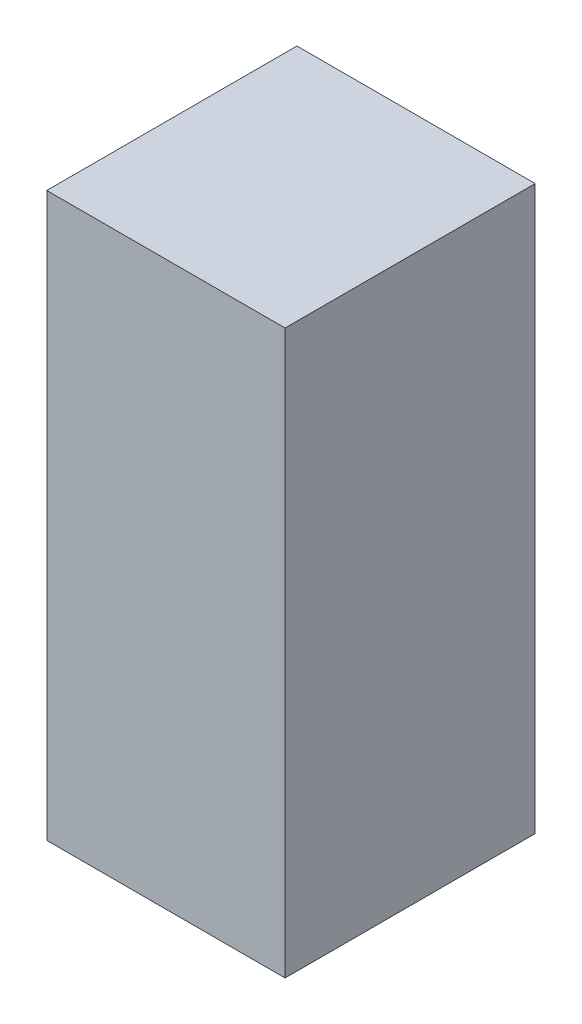
ISO-10303-21;
HEADER;
FILE_DESCRIPTION(('STEP AP214'),'2;1');
FILE_NAME('part.step','',(''),(''),'','','');
FILE_SCHEMA(('AUTOMOTIVE_DESIGN { 1 0 10303 214 1 1 1 1 }'));
ENDSEC;
DATA;
#1=APPLICATION_CONTEXT('core data for automotive mechanical design processes');
#2=APPLICATION_PROTOCOL_DEFINITION('international standard','automotive_design',2000,#1);
#3=PRODUCT_CONTEXT('',#1,'mechanical');
#4=PRODUCT('Part','Part','',(#3));
#5=PRODUCT_RELATED_PRODUCT_CATEGORY('part','',(#4));
#6=PRODUCT_DEFINITION_FORMATION('','',#4);
#7=PRODUCT_DEFINITION_CONTEXT('part definition',#1,'design');
#8=PRODUCT_DEFINITION('design','',#6,#7);
#9=PRODUCT_DEFINITION_SHAPE('','',#8);
#10=(LENGTH_UNIT() NAMED_UNIT(*) SI_UNIT(.MILLI.,.METRE.));
#11=(NAMED_UNIT(*) PLANE_ANGLE_UNIT() SI_UNIT($,.RADIAN.));
#12=(NAMED_UNIT(*) SI_UNIT($,.STERADIAN.) SOLID_ANGLE_UNIT());
#13=UNCERTAINTY_MEASURE_WITH_UNIT(LENGTH_MEASURE(1.E-05),#10,'distance_accuracy_value','');
#14=(GEOMETRIC_REPRESENTATION_CONTEXT(3) GLOBAL_UNCERTAINTY_ASSIGNED_CONTEXT((#13)) GLOBAL_UNIT_ASSIGNED_CONTEXT((#10,
#11,#12)) REPRESENTATION_CONTEXT('',''));
#15=CARTESIAN_POINT('',(0.,0.,0.));
#16=DIRECTION('',(0.,0.,1.));
#17=DIRECTION('',(1.,0.,0.));
#18=AXIS2_PLACEMENT_3D('',#15,#16,#17);
#19=CARTESIAN_POINT('',(0.1905,0.45000164,0.3999992));
#20=DIRECTION('',(0.,0.,1.));
#21=DIRECTION('',(1.,0.,0.));
#22=AXIS2_PLACEMENT_3D('',#19,#20,#21);
#23=PLANE('',#22);
#24=DIRECTION('',(1.,0.,0.));
#25=VECTOR('',#24,1.);
#26=CARTESIAN_POINT('',(-0.1905,0.45000164,0.3999992));
#27=LINE('',#26,#25);
#28=CARTESIAN_POINT('',(-0.1905,0.45000164,0.3999992));
#29=VERTEX_POINT('',#28);
#30=CARTESIAN_POINT('',(0.1905,0.45000164,0.3999992));
#31=VERTEX_POINT('',#30);
#32=EDGE_CURVE('E20',#29,#31,#27,.T.);
#33=ORIENTED_EDGE('',*,*,#32,.F.);
#34=DIRECTION('',(0.,1.,0.));
#35=VECTOR('',#34,1.);
#36=CARTESIAN_POINT('',(-0.1905,-0.4499991,0.3999992));
#37=LINE('',#36,#35);
#38=CARTESIAN_POINT('',(-0.1905,-0.4499991,0.3999992));
#39=VERTEX_POINT('',#38);
#40=EDGE_CURVE('E96',#39,#29,#37,.T.);
#41=ORIENTED_EDGE('',*,*,#40,.F.);
#42=DIRECTION('',(-1.,0.,0.));
#43=VECTOR('',#42,1.);
#44=CARTESIAN_POINT('',(0.1905,-0.4499991,0.3999992));
#45=LINE('',#44,#43);
#46=CARTESIAN_POINT('',(0.1905,-0.4499991,0.3999992));
#47=VERTEX_POINT('',#46);
#48=EDGE_CURVE('E84',#47,#39,#45,.T.);
#49=ORIENTED_EDGE('',*,*,#48,.F.);
#50=DIRECTION('',(0.,-1.,0.));
#51=VECTOR('',#50,1.);
#52=CARTESIAN_POINT('',(0.1905,0.45000164,0.3999992));
#53=LINE('',#52,#51);
#54=EDGE_CURVE('E88',#31,#47,#53,.T.);
#55=ORIENTED_EDGE('',*,*,#54,.F.);
#56=EDGE_LOOP('',(#33,#41,#49,#55));
#57=FACE_BOUND('',#56,.T.);
#58=ADVANCED_FACE('F17',(#57),#23,.T.);
#59=CARTESIAN_POINT('',(0.1905,0.45000164,0.));
#60=DIRECTION('',(0.,0.,1.));
#61=DIRECTION('',(1.,0.,0.));
#62=AXIS2_PLACEMENT_3D('',#59,#60,#61);
#63=PLANE('',#62);
#64=DIRECTION('',(0.,-1.,0.));
#65=VECTOR('',#64,1.);
#66=CARTESIAN_POINT('',(0.1905,0.45000164,0.));
#67=LINE('',#66,#65);
#68=CARTESIAN_POINT('',(0.1905,0.45000164,0.));
#69=VERTEX_POINT('',#68);
#70=CARTESIAN_POINT('',(0.1905,-0.4499991,0.));
#71=VERTEX_POINT('',#70);
#72=EDGE_CURVE('E72',#69,#71,#67,.T.);
#73=ORIENTED_EDGE('',*,*,#72,.T.);
#74=DIRECTION('',(-1.,0.,0.));
#75=VECTOR('',#74,1.);
#76=CARTESIAN_POINT('',(0.1905,-0.4499991,0.));
#77=LINE('',#76,#75);
#78=CARTESIAN_POINT('',(-0.1905,-0.4499991,0.));
#79=VERTEX_POINT('',#78);
#80=EDGE_CURVE('E101',#71,#79,#77,.T.);
#81=ORIENTED_EDGE('',*,*,#80,.T.);
#82=DIRECTION('',(0.,1.,0.));
#83=VECTOR('',#82,1.);
#84=CARTESIAN_POINT('',(-0.1905,-0.4499991,0.));
#85=LINE('',#84,#83);
#86=CARTESIAN_POINT('',(-0.1905,0.45000164,0.));
#87=VERTEX_POINT('',#86);
#88=EDGE_CURVE('E74',#79,#87,#85,.T.);
#89=ORIENTED_EDGE('',*,*,#88,.T.);
#90=DIRECTION('',(1.,0.,0.));
#91=VECTOR('',#90,1.);
#92=CARTESIAN_POINT('',(-0.1905,0.45000164,0.));
#93=LINE('',#92,#91);
#94=EDGE_CURVE('E11',#87,#69,#93,.T.);
#95=ORIENTED_EDGE('',*,*,#94,.T.);
#96=EDGE_LOOP('',(#73,#81,#89,#95));
#97=FACE_BOUND('',#96,.T.);
#98=ADVANCED_FACE('F70',(#97),#63,.F.);
#99=CARTESIAN_POINT('',(-0.1905,0.45000164,0.));
#100=DIRECTION('',(0.,1.,0.));
#101=DIRECTION('',(1.,0.,0.));
#102=AXIS2_PLACEMENT_3D('',#99,#100,#101);
#103=PLANE('',#102);
#104=DIRECTION('',(0.,0.,1.));
#105=VECTOR('',#104,1.);
#106=CARTESIAN_POINT('',(-0.1905,0.45000164,0.));
#107=LINE('',#106,#105);
#108=EDGE_CURVE('E100',#87,#29,#107,.T.);
#109=ORIENTED_EDGE('',*,*,#108,.T.);
#110=ORIENTED_EDGE('',*,*,#32,.T.);
#111=DIRECTION('',(0.,0.,1.));
#112=VECTOR('',#111,1.);
#113=CARTESIAN_POINT('',(0.1905,0.45000164,0.));
#114=LINE('',#113,#112);
#115=EDGE_CURVE('E80',#69,#31,#114,.T.);
#116=ORIENTED_EDGE('',*,*,#115,.F.);
#117=ORIENTED_EDGE('',*,*,#94,.F.);
#118=EDGE_LOOP('',(#109,#110,#116,#117));
#119=FACE_BOUND('',#118,.T.);
#120=ADVANCED_FACE('F86',(#119),#103,.T.);
#121=CARTESIAN_POINT('',(-0.1905,-0.4499991,0.));
#122=DIRECTION('',(-1.,0.,0.));
#123=DIRECTION('',(0.,0.,1.));
#124=AXIS2_PLACEMENT_3D('',#121,#122,#123);
#125=PLANE('',#124);
#126=DIRECTION('',(0.,0.,1.));
#127=VECTOR('',#126,1.);
#128=CARTESIAN_POINT('',(-0.1905,-0.4499991,0.));
#129=LINE('',#128,#127);
#130=EDGE_CURVE('E104',#79,#39,#129,.T.);
#131=ORIENTED_EDGE('',*,*,#130,.T.);
#132=ORIENTED_EDGE('',*,*,#40,.T.);
#133=ORIENTED_EDGE('',*,*,#108,.F.);
#134=ORIENTED_EDGE('',*,*,#88,.F.);
#135=EDGE_LOOP('',(#131,#132,#133,#134));
#136=FACE_BOUND('',#135,.T.);
#137=ADVANCED_FACE('F118',(#136),#125,.T.);
#138=CARTESIAN_POINT('',(0.1905,-0.4499991,0.));
#139=DIRECTION('',(0.,-1.,0.));
#140=DIRECTION('',(0.,0.,-1.));
#141=AXIS2_PLACEMENT_3D('',#138,#139,#140);
#142=PLANE('',#141);
#143=DIRECTION('',(0.,0.,1.));
#144=VECTOR('',#143,1.);
#145=CARTESIAN_POINT('',(0.1905,-0.4499991,0.));
#146=LINE('',#145,#144);
#147=EDGE_CURVE('E82',#71,#47,#146,.T.);
#148=ORIENTED_EDGE('',*,*,#147,.T.);
#149=ORIENTED_EDGE('',*,*,#48,.T.);
#150=ORIENTED_EDGE('',*,*,#130,.F.);
#151=ORIENTED_EDGE('',*,*,#80,.F.);
#152=EDGE_LOOP('',(#148,#149,#150,#151));
#153=FACE_BOUND('',#152,.T.);
#154=ADVANCED_FACE('F121',(#153),#142,.T.);
#155=CARTESIAN_POINT('',(0.1905,0.45000164,0.));
#156=DIRECTION('',(1.,0.,0.));
#157=DIRECTION('',(0.,1.,0.));
#158=AXIS2_PLACEMENT_3D('',#155,#156,#157);
#159=PLANE('',#158);
#160=ORIENTED_EDGE('',*,*,#115,.T.);
#161=ORIENTED_EDGE('',*,*,#54,.T.);
#162=ORIENTED_EDGE('',*,*,#147,.F.);
#163=ORIENTED_EDGE('',*,*,#72,.F.);
#164=EDGE_LOOP('',(#160,#161,#162,#163));
#165=FACE_BOUND('',#164,.T.);
#166=ADVANCED_FACE('F78',(#165),#159,.T.);
#167=CLOSED_SHELL('',(#58,#98,#120,#137,#154,#166));
#168=MANIFOLD_SOLID_BREP('B1',#167);
#169=ADVANCED_BREP_SHAPE_REPRESENTATION('',(#18,#168),#14);
#170=SHAPE_DEFINITION_REPRESENTATION(#9,#169);
ENDSEC;
END-ISO-10303-21;
